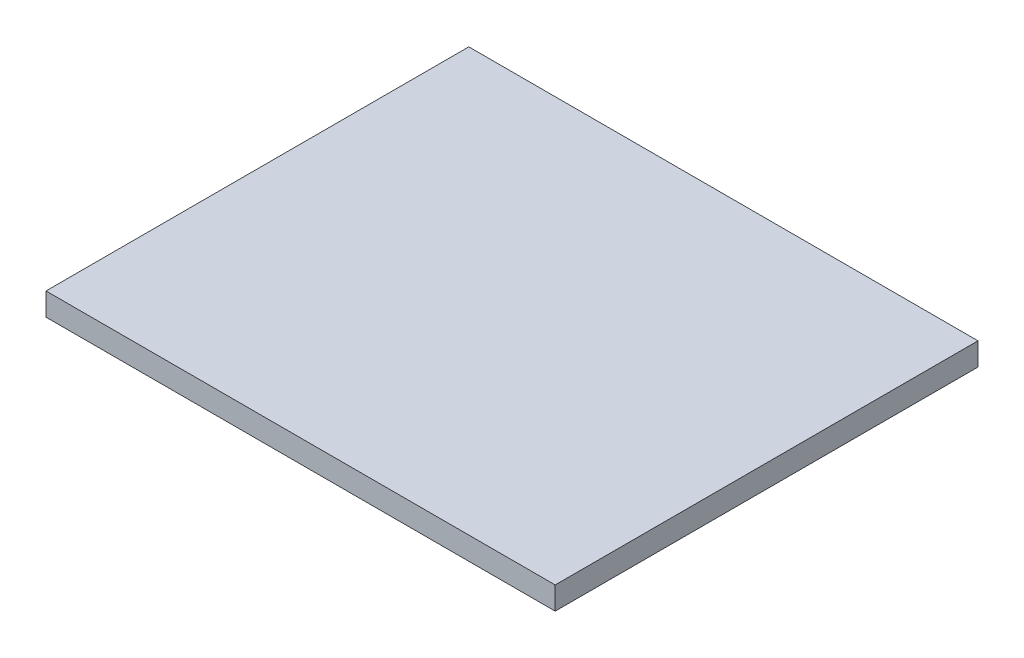
ISO-10303-21;
HEADER;
FILE_DESCRIPTION(('STEP AP214'),'2;1');
FILE_NAME('part.step','',(''),(''),'','','');
FILE_SCHEMA(('AUTOMOTIVE_DESIGN { 1 0 10303 214 1 1 1 1 }'));
ENDSEC;
DATA;
#1=APPLICATION_CONTEXT('core data for automotive mechanical design processes');
#2=APPLICATION_PROTOCOL_DEFINITION('international standard','automotive_design',2000,#1);
#3=PRODUCT_CONTEXT('',#1,'mechanical');
#4=PRODUCT('Part','Part','',(#3));
#5=PRODUCT_RELATED_PRODUCT_CATEGORY('part','',(#4));
#6=PRODUCT_DEFINITION_FORMATION('','',#4);
#7=PRODUCT_DEFINITION_CONTEXT('part definition',#1,'design');
#8=PRODUCT_DEFINITION('design','',#6,#7);
#9=PRODUCT_DEFINITION_SHAPE('','',#8);
#10=(LENGTH_UNIT() NAMED_UNIT(*) SI_UNIT(.MILLI.,.METRE.));
#11=(NAMED_UNIT(*) PLANE_ANGLE_UNIT() SI_UNIT($,.RADIAN.));
#12=(NAMED_UNIT(*) SI_UNIT($,.STERADIAN.) SOLID_ANGLE_UNIT());
#13=UNCERTAINTY_MEASURE_WITH_UNIT(LENGTH_MEASURE(1.E-05),#10,'distance_accuracy_value','');
#14=(GEOMETRIC_REPRESENTATION_CONTEXT(3) GLOBAL_UNCERTAINTY_ASSIGNED_CONTEXT((#13)) GLOBAL_UNIT_ASSIGNED_CONTEXT((#10,
#11,#12)) REPRESENTATION_CONTEXT('',''));
#15=CARTESIAN_POINT('',(0.,0.,0.));
#16=DIRECTION('',(0.,0.,1.));
#17=DIRECTION('',(1.,0.,0.));
#18=AXIS2_PLACEMENT_3D('',#15,#16,#17);
#19=CARTESIAN_POINT('',(0.,-2.5,0.));
#20=DIRECTION('',(0.,-1.,0.));
#21=DIRECTION('',(0.,0.,-1.));
#22=AXIS2_PLACEMENT_3D('',#19,#20,#21);
#23=PLANE('',#22);
#24=DIRECTION('',(0.,0.,-1.));
#25=VECTOR('',#24,1.);
#26=CARTESIAN_POINT('',(-3.,-2.5,20.75));
#27=LINE('',#26,#25);
#28=CARTESIAN_POINT('',(-3.,-2.5,20.75));
#29=VERTEX_POINT('',#28);
#30=CARTESIAN_POINT('',(-3.,-2.5,18.25));
#31=VERTEX_POINT('',#30);
#32=EDGE_CURVE('E288',#29,#31,#27,.T.);
#33=ORIENTED_EDGE('',*,*,#32,.F.);
#34=DIRECTION('',(-1.,0.,0.));
#35=VECTOR('',#34,1.);
#36=CARTESIAN_POINT('',(25.5,-2.5,20.75));
#37=LINE('',#36,#35);
#38=CARTESIAN_POINT('',(-25.5,-2.5,20.75));
#39=VERTEX_POINT('',#38);
#40=EDGE_CURVE('E292',#29,#39,#37,.T.);
#41=ORIENTED_EDGE('',*,*,#40,.T.);
#42=DIRECTION('',(0.,0.,-1.));
#43=VECTOR('',#42,1.);
#44=CARTESIAN_POINT('',(-25.5,-2.5,20.75));
#45=LINE('',#44,#43);
#46=CARTESIAN_POINT('',(-25.5,-2.5,2.99999999999999));
#47=VERTEX_POINT('',#46);
#48=EDGE_CURVE('E271',#39,#47,#45,.T.);
#49=ORIENTED_EDGE('',*,*,#48,.T.);
#50=DIRECTION('',(-1.,0.,0.));
#51=VECTOR('',#50,1.);
#52=CARTESIAN_POINT('',(-3.,-2.5,2.99999999999999));
#53=LINE('',#52,#51);
#54=CARTESIAN_POINT('',(-23.,-2.5,2.99999999999999));
#55=VERTEX_POINT('',#54);
#56=EDGE_CURVE('E280',#55,#47,#53,.T.);
#57=ORIENTED_EDGE('',*,*,#56,.F.);
#58=DIRECTION('',(0.,0.,-1.));
#59=VECTOR('',#58,1.);
#60=CARTESIAN_POINT('',(-23.,-2.5,18.25));
#61=LINE('',#60,#59);
#62=CARTESIAN_POINT('',(-23.,-2.5,18.25));
#63=VERTEX_POINT('',#62);
#64=EDGE_CURVE('E470',#63,#55,#61,.T.);
#65=ORIENTED_EDGE('',*,*,#64,.F.);
#66=DIRECTION('',(-1.,0.,0.));
#67=VECTOR('',#66,1.);
#68=CARTESIAN_POINT('',(23.,-2.5,18.25));
#69=LINE('',#68,#67);
#70=EDGE_CURVE('E488',#31,#63,#69,.T.);
#71=ORIENTED_EDGE('',*,*,#70,.F.);
#72=EDGE_LOOP('',(#33,#41,#49,#57,#65,#71));
#73=FACE_BOUND('',#72,.T.);
#74=ADVANCED_FACE('F33',(#73),#23,.T.);
#75=DIRECTION('',(0.,0.,1.));
#76=VECTOR('',#75,1.);
#77=CARTESIAN_POINT('',(3.,-2.5,20.75));
#78=LINE('',#77,#76);
#79=CARTESIAN_POINT('',(3.,-2.5,18.25));
#80=VERTEX_POINT('',#79);
#81=CARTESIAN_POINT('',(3.,-2.5,20.75));
#82=VERTEX_POINT('',#81);
#83=EDGE_CURVE('E277',#80,#82,#78,.T.);
#84=ORIENTED_EDGE('',*,*,#83,.F.);
#85=CARTESIAN_POINT('',(23.,-2.5,18.25));
#86=VERTEX_POINT('',#85);
#87=EDGE_CURVE('E485',#86,#80,#69,.T.);
#88=ORIENTED_EDGE('',*,*,#87,.F.);
#89=DIRECTION('',(0.,0.,1.));
#90=VECTOR('',#89,1.);
#91=CARTESIAN_POINT('',(23.,-2.5,-18.25));
#92=LINE('',#91,#90);
#93=CARTESIAN_POINT('',(23.,-2.5,2.99999999999999));
#94=VERTEX_POINT('',#93);
#95=EDGE_CURVE('E492',#94,#86,#92,.T.);
#96=ORIENTED_EDGE('',*,*,#95,.F.);
#97=DIRECTION('',(-1.,0.,0.));
#98=VECTOR('',#97,1.);
#99=CARTESIAN_POINT('',(25.5,-2.5,2.99999999999999));
#100=LINE('',#99,#98);
#101=CARTESIAN_POINT('',(25.5,-2.5,2.99999999999999));
#102=VERTEX_POINT('',#101);
#103=EDGE_CURVE('E528',#102,#94,#100,.T.);
#104=ORIENTED_EDGE('',*,*,#103,.F.);
#105=DIRECTION('',(0.,0.,1.));
#106=VECTOR('',#105,1.);
#107=CARTESIAN_POINT('',(25.5,-2.5,-20.75));
#108=LINE('',#107,#106);
#109=CARTESIAN_POINT('',(25.5,-2.5,20.75));
#110=VERTEX_POINT('',#109);
#111=EDGE_CURVE('E450',#102,#110,#108,.T.);
#112=ORIENTED_EDGE('',*,*,#111,.T.);
#113=EDGE_CURVE('E300',#110,#82,#37,.T.);
#114=ORIENTED_EDGE('',*,*,#113,.T.);
#115=EDGE_LOOP('',(#84,#88,#96,#104,#112,#114));
#116=FACE_BOUND('',#115,.T.);
#117=ADVANCED_FACE('F555',(#116),#23,.T.);
#118=DIRECTION('',(1.,0.,0.));
#119=VECTOR('',#118,1.);
#120=CARTESIAN_POINT('',(25.5,-2.5,-3.00000000000001));
#121=LINE('',#120,#119);
#122=CARTESIAN_POINT('',(23.,-2.5,-3.00000000000001));
#123=VERTEX_POINT('',#122);
#124=CARTESIAN_POINT('',(25.5,-2.5,-3.00000000000001));
#125=VERTEX_POINT('',#124);
#126=EDGE_CURVE('E530',#123,#125,#121,.T.);
#127=ORIENTED_EDGE('',*,*,#126,.F.);
#128=CARTESIAN_POINT('',(23.,-2.5,-18.25));
#129=VERTEX_POINT('',#128);
#130=EDGE_CURVE('E489',#129,#123,#92,.T.);
#131=ORIENTED_EDGE('',*,*,#130,.F.);
#132=DIRECTION('',(1.,0.,0.));
#133=VECTOR('',#132,1.);
#134=CARTESIAN_POINT('',(-23.,-2.5,-18.25));
#135=LINE('',#134,#133);
#136=CARTESIAN_POINT('',(3.00000000000001,-2.5,-18.25));
#137=VERTEX_POINT('',#136);
#138=EDGE_CURVE('E473',#137,#129,#135,.T.);
#139=ORIENTED_EDGE('',*,*,#138,.F.);
#140=DIRECTION('',(0.,0.,1.));
#141=VECTOR('',#140,1.);
#142=CARTESIAN_POINT('',(3.,-2.5,-3.00000000000001));
#143=LINE('',#142,#141);
#144=CARTESIAN_POINT('',(3.00000000000001,-2.5,-20.75));
#145=VERTEX_POINT('',#144);
#146=EDGE_CURVE('E533',#145,#137,#143,.T.);
#147=ORIENTED_EDGE('',*,*,#146,.F.);
#148=DIRECTION('',(1.,0.,0.));
#149=VECTOR('',#148,1.);
#150=CARTESIAN_POINT('',(-25.5,-2.5,-20.75));
#151=LINE('',#150,#149);
#152=CARTESIAN_POINT('',(25.5,-2.5,-20.75));
#153=VERTEX_POINT('',#152);
#154=EDGE_CURVE('E315',#145,#153,#151,.T.);
#155=ORIENTED_EDGE('',*,*,#154,.T.);
#156=EDGE_CURVE('E453',#153,#125,#108,.T.);
#157=ORIENTED_EDGE('',*,*,#156,.T.);
#158=EDGE_LOOP('',(#127,#131,#139,#147,#155,#157));
#159=FACE_BOUND('',#158,.T.);
#160=ADVANCED_FACE('F591',(#159),#23,.T.);
#161=CARTESIAN_POINT('',(-25.5,-2.5,-20.75));
#162=DIRECTION('',(0.,0.,1.));
#163=DIRECTION('',(1.,0.,0.));
#164=AXIS2_PLACEMENT_3D('',#161,#162,#163);
#165=PLANE('',#164);
#166=ORIENTED_EDGE('',*,*,#154,.F.);
#167=DIRECTION('',(0.,-1.,0.));
#168=VECTOR('',#167,1.);
#169=CARTESIAN_POINT('',(3.00000000000001,0.,-20.75));
#170=LINE('',#169,#168);
#171=CARTESIAN_POINT('',(3.00000000000001,-2.,-20.75));
#172=VERTEX_POINT('',#171);
#173=EDGE_CURVE('E518',#172,#145,#170,.T.);
#174=ORIENTED_EDGE('',*,*,#173,.F.);
#175=CARTESIAN_POINT('',(1.00000000000001,-2.,-20.75));
#176=DIRECTION('',(0.,0.,1.));
#177=DIRECTION('',(1.,0.,0.));
#178=AXIS2_PLACEMENT_3D('',#175,#176,#177);
#179=CIRCLE('',#178,2.);
#180=CARTESIAN_POINT('',(1.00000000000001,0.,-20.75));
#181=VERTEX_POINT('',#180);
#182=EDGE_CURVE('E405',#172,#181,#179,.T.);
#183=ORIENTED_EDGE('',*,*,#182,.T.);
#184=DIRECTION('',(1.,0.,0.));
#185=VECTOR('',#184,1.);
#186=CARTESIAN_POINT('',(-25.5,0.,-20.75));
#187=LINE('',#186,#185);
#188=CARTESIAN_POINT('',(25.5,0.,-20.75));
#189=VERTEX_POINT('',#188);
#190=EDGE_CURVE('E307',#181,#189,#187,.T.);
#191=ORIENTED_EDGE('',*,*,#190,.T.);
#192=DIRECTION('',(0.,1.,0.));
#193=VECTOR('',#192,1.);
#194=CARTESIAN_POINT('',(25.5,-2.5,-20.75));
#195=LINE('',#194,#193);
#196=EDGE_CURVE('E321',#153,#189,#195,.T.);
#197=ORIENTED_EDGE('',*,*,#196,.F.);
#198=EDGE_LOOP('',(#166,#174,#183,#191,#197));
#199=FACE_BOUND('',#198,.T.);
#200=ADVANCED_FACE('F605',(#199),#165,.F.);
#201=CARTESIAN_POINT('',(25.5,-2.5,-20.75));
#202=DIRECTION('',(-1.,0.,0.));
#203=DIRECTION('',(0.,0.,1.));
#204=AXIS2_PLACEMENT_3D('',#201,#202,#203);
#205=PLANE('',#204);
#206=ORIENTED_EDGE('',*,*,#111,.F.);
#207=DIRECTION('',(0.,-1.,0.));
#208=VECTOR('',#207,1.);
#209=CARTESIAN_POINT('',(25.5,0.,2.99999999999999));
#210=LINE('',#209,#208);
#211=CARTESIAN_POINT('',(25.5,-2.,2.99999999999999));
#212=VERTEX_POINT('',#211);
#213=EDGE_CURVE('E434',#212,#102,#210,.T.);
#214=ORIENTED_EDGE('',*,*,#213,.F.);
#215=CARTESIAN_POINT('',(25.5,-2.,0.999999999999994));
#216=DIRECTION('',(-1.,0.,0.));
#217=DIRECTION('',(0.,0.,1.));
#218=AXIS2_PLACEMENT_3D('',#215,#216,#217);
#219=CIRCLE('',#218,2.);
#220=CARTESIAN_POINT('',(25.5,0.,0.999999999999994));
#221=VERTEX_POINT('',#220);
#222=EDGE_CURVE('E424',#212,#221,#219,.T.);
#223=ORIENTED_EDGE('',*,*,#222,.T.);
#224=DIRECTION('',(0.,0.,1.));
#225=VECTOR('',#224,1.);
#226=CARTESIAN_POINT('',(25.5,0.,-20.75));
#227=LINE('',#226,#225);
#228=CARTESIAN_POINT('',(25.5,0.,20.75));
#229=VERTEX_POINT('',#228);
#230=EDGE_CURVE('E306',#221,#229,#227,.T.);
#231=ORIENTED_EDGE('',*,*,#230,.T.);
#232=DIRECTION('',(0.,1.,0.));
#233=VECTOR('',#232,1.);
#234=CARTESIAN_POINT('',(25.5,-2.5,20.75));
#235=LINE('',#234,#233);
#236=EDGE_CURVE('E318',#110,#229,#235,.T.);
#237=ORIENTED_EDGE('',*,*,#236,.F.);
#238=EDGE_LOOP('',(#206,#214,#223,#231,#237));
#239=FACE_BOUND('',#238,.T.);
#240=ADVANCED_FACE('F431',(#239),#205,.F.);
#241=CARTESIAN_POINT('',(25.5,-2.5,20.75));
#242=DIRECTION('',(0.,0.,-1.));
#243=DIRECTION('',(-1.,0.,0.));
#244=AXIS2_PLACEMENT_3D('',#241,#242,#243);
#245=PLANE('',#244);
#246=ORIENTED_EDGE('',*,*,#40,.F.);
#247=DIRECTION('',(0.,-1.,0.));
#248=VECTOR('',#247,1.);
#249=CARTESIAN_POINT('',(-3.,0.,20.75));
#250=LINE('',#249,#248);
#251=CARTESIAN_POINT('',(-3.,-2.,20.75));
#252=VERTEX_POINT('',#251);
#253=EDGE_CURVE('E513',#252,#29,#250,.T.);
#254=ORIENTED_EDGE('',*,*,#253,.F.);
#255=CARTESIAN_POINT('',(-0.999999999999999,-2.,20.75));
#256=DIRECTION('',(0.,0.,-1.));
#257=DIRECTION('',(-1.,0.,0.));
#258=AXIS2_PLACEMENT_3D('',#255,#256,#257);
#259=CIRCLE('',#258,2.);
#260=CARTESIAN_POINT('',(-1.,0.,20.75));
#261=VERTEX_POINT('',#260);
#262=EDGE_CURVE('E11',#252,#261,#259,.T.);
#263=ORIENTED_EDGE('',*,*,#262,.T.);
#264=DIRECTION('',(-1.,0.,0.));
#265=VECTOR('',#264,1.);
#266=CARTESIAN_POINT('',(25.5,0.,20.75));
#267=LINE('',#266,#265);
#268=CARTESIAN_POINT('',(-25.5,0.,20.75));
#269=VERTEX_POINT('',#268);
#270=EDGE_CURVE('E310',#261,#269,#267,.T.);
#271=ORIENTED_EDGE('',*,*,#270,.T.);
#272=DIRECTION('',(0.,1.,0.));
#273=VECTOR('',#272,1.);
#274=CARTESIAN_POINT('',(-25.5,-2.5,20.75));
#275=LINE('',#274,#273);
#276=EDGE_CURVE('E298',#39,#269,#275,.T.);
#277=ORIENTED_EDGE('',*,*,#276,.F.);
#278=EDGE_LOOP('',(#246,#254,#263,#271,#277));
#279=FACE_BOUND('',#278,.T.);
#280=ADVANCED_FACE('F553',(#279),#245,.F.);
#281=CARTESIAN_POINT('',(-25.5,-2.5,20.75));
#282=DIRECTION('',(1.,0.,0.));
#283=DIRECTION('',(0.,0.,-1.));
#284=AXIS2_PLACEMENT_3D('',#281,#282,#283);
#285=PLANE('',#284);
#286=CARTESIAN_POINT('',(-25.5,-2.5,-3.00000000000001));
#287=VERTEX_POINT('',#286);
#288=CARTESIAN_POINT('',(-25.5,-2.5,-20.75));
#289=VERTEX_POINT('',#288);
#290=EDGE_CURVE('E295',#287,#289,#45,.T.);
#291=ORIENTED_EDGE('',*,*,#290,.F.);
#292=DIRECTION('',(0.,-1.,0.));
#293=VECTOR('',#292,1.);
#294=CARTESIAN_POINT('',(-25.5,0.,-3.00000000000001));
#295=LINE('',#294,#293);
#296=CARTESIAN_POINT('',(-25.5,-2.,-3.00000000000001));
#297=VERTEX_POINT('',#296);
#298=EDGE_CURVE('E276',#297,#287,#295,.T.);
#299=ORIENTED_EDGE('',*,*,#298,.F.);
#300=CARTESIAN_POINT('',(-25.5,-2.,-1.00000000000001));
#301=DIRECTION('',(1.,0.,0.));
#302=DIRECTION('',(0.,0.,-1.));
#303=AXIS2_PLACEMENT_3D('',#300,#301,#302);
#304=CIRCLE('',#303,2.);
#305=CARTESIAN_POINT('',(-25.5,0.,-1.));
#306=VERTEX_POINT('',#305);
#307=EDGE_CURVE('E395',#297,#306,#304,.T.);
#308=ORIENTED_EDGE('',*,*,#307,.T.);
#309=DIRECTION('',(0.,0.,-1.));
#310=VECTOR('',#309,1.);
#311=CARTESIAN_POINT('',(-25.5,0.,20.75));
#312=LINE('',#311,#310);
#313=CARTESIAN_POINT('',(-25.5,0.,-20.75));
#314=VERTEX_POINT('',#313);
#315=EDGE_CURVE('E313',#306,#314,#312,.T.);
#316=ORIENTED_EDGE('',*,*,#315,.T.);
#317=DIRECTION('',(0.,1.,0.));
#318=VECTOR('',#317,1.);
#319=CARTESIAN_POINT('',(-25.5,-2.5,-20.75));
#320=LINE('',#319,#318);
#321=EDGE_CURVE('E294',#289,#314,#320,.T.);
#322=ORIENTED_EDGE('',*,*,#321,.F.);
#323=EDGE_LOOP('',(#291,#299,#308,#316,#322));
#324=FACE_BOUND('',#323,.T.);
#325=ADVANCED_FACE('F827',(#324),#285,.F.);
#326=CARTESIAN_POINT('',(-23.,-2.5,-18.25));
#327=DIRECTION('',(0.,0.,1.));
#328=DIRECTION('',(1.,0.,0.));
#329=AXIS2_PLACEMENT_3D('',#326,#327,#328);
#330=PLANE('',#329);
#331=DIRECTION('',(0.,1.,0.));
#332=VECTOR('',#331,1.);
#333=CARTESIAN_POINT('',(3.00000000000001,-2.5,-18.25));
#334=LINE('',#333,#332);
#335=CARTESIAN_POINT('',(3.00000000000001,-2.,-18.25));
#336=VERTEX_POINT('',#335);
#337=EDGE_CURVE('E505',#137,#336,#334,.T.);
#338=ORIENTED_EDGE('',*,*,#337,.F.);
#339=ORIENTED_EDGE('',*,*,#138,.T.);
#340=DIRECTION('',(0.,1.,0.));
#341=VECTOR('',#340,1.);
#342=CARTESIAN_POINT('',(23.,-2.5,-18.25));
#343=LINE('',#342,#341);
#344=CARTESIAN_POINT('',(23.,0.,-18.25));
#345=VERTEX_POINT('',#344);
#346=EDGE_CURVE('E459',#129,#345,#343,.T.);
#347=ORIENTED_EDGE('',*,*,#346,.T.);
#348=DIRECTION('',(1.,0.,0.));
#349=VECTOR('',#348,1.);
#350=CARTESIAN_POINT('',(-23.,0.,-18.25));
#351=LINE('',#350,#349);
#352=CARTESIAN_POINT('',(1.00000000000001,0.,-18.25));
#353=VERTEX_POINT('',#352);
#354=EDGE_CURVE('E482',#353,#345,#351,.T.);
#355=ORIENTED_EDGE('',*,*,#354,.F.);
#356=CARTESIAN_POINT('',(1.00000000000001,-2.,-18.25));
#357=DIRECTION('',(0.,0.,1.));
#358=DIRECTION('',(1.,0.,0.));
#359=AXIS2_PLACEMENT_3D('',#356,#357,#358);
#360=CIRCLE('',#359,2.);
#361=EDGE_CURVE('E403',#353,#336,#360,.F.);
#362=ORIENTED_EDGE('',*,*,#361,.T.);
#363=EDGE_LOOP('',(#338,#339,#347,#355,#362));
#364=FACE_BOUND('',#363,.T.);
#365=ADVANCED_FACE('F629',(#364),#330,.T.);
#366=CARTESIAN_POINT('',(23.,-2.5,-18.25));
#367=DIRECTION('',(-1.,0.,0.));
#368=DIRECTION('',(0.,0.,1.));
#369=AXIS2_PLACEMENT_3D('',#366,#367,#368);
#370=PLANE('',#369);
#371=DIRECTION('',(0.,1.,0.));
#372=VECTOR('',#371,1.);
#373=CARTESIAN_POINT('',(23.,-2.5,2.99999999999999));
#374=LINE('',#373,#372);
#375=CARTESIAN_POINT('',(23.,-2.,2.99999999999999));
#376=VERTEX_POINT('',#375);
#377=EDGE_CURVE('E500',#94,#376,#374,.T.);
#378=ORIENTED_EDGE('',*,*,#377,.F.);
#379=ORIENTED_EDGE('',*,*,#95,.T.);
#380=DIRECTION('',(0.,1.,0.));
#381=VECTOR('',#380,1.);
#382=CARTESIAN_POINT('',(23.,-2.5,18.25));
#383=LINE('',#382,#381);
#384=CARTESIAN_POINT('',(23.,0.,18.25));
#385=VERTEX_POINT('',#384);
#386=EDGE_CURVE('E462',#86,#385,#383,.T.);
#387=ORIENTED_EDGE('',*,*,#386,.T.);
#388=DIRECTION('',(0.,0.,1.));
#389=VECTOR('',#388,1.);
#390=CARTESIAN_POINT('',(23.,0.,-18.25));
#391=LINE('',#390,#389);
#392=CARTESIAN_POINT('',(23.,0.,0.999999999999994));
#393=VERTEX_POINT('',#392);
#394=EDGE_CURVE('E442',#393,#385,#391,.T.);
#395=ORIENTED_EDGE('',*,*,#394,.F.);
#396=CARTESIAN_POINT('',(23.,-2.,0.999999999999994));
#397=DIRECTION('',(-1.,0.,0.));
#398=DIRECTION('',(0.,0.,1.));
#399=AXIS2_PLACEMENT_3D('',#396,#397,#398);
#400=CIRCLE('',#399,2.);
#401=EDGE_CURVE('E422',#393,#376,#400,.F.);
#402=ORIENTED_EDGE('',*,*,#401,.T.);
#403=EDGE_LOOP('',(#378,#379,#387,#395,#402));
#404=FACE_BOUND('',#403,.T.);
#405=ADVANCED_FACE('F568',(#404),#370,.T.);
#406=CARTESIAN_POINT('',(23.,-2.5,18.25));
#407=DIRECTION('',(0.,0.,-1.));
#408=DIRECTION('',(-1.,0.,0.));
#409=AXIS2_PLACEMENT_3D('',#406,#407,#408);
#410=PLANE('',#409);
#411=DIRECTION('',(0.,1.,0.));
#412=VECTOR('',#411,1.);
#413=CARTESIAN_POINT('',(-3.,-2.5,18.25));
#414=LINE('',#413,#412);
#415=CARTESIAN_POINT('',(-3.,-2.,18.25));
#416=VERTEX_POINT('',#415);
#417=EDGE_CURVE('E496',#31,#416,#414,.T.);
#418=ORIENTED_EDGE('',*,*,#417,.F.);
#419=ORIENTED_EDGE('',*,*,#70,.T.);
#420=DIRECTION('',(0.,1.,0.));
#421=VECTOR('',#420,1.);
#422=CARTESIAN_POINT('',(-23.,-2.5,18.25));
#423=LINE('',#422,#421);
#424=CARTESIAN_POINT('',(-23.,0.,18.25));
#425=VERTEX_POINT('',#424);
#426=EDGE_CURVE('E464',#63,#425,#423,.T.);
#427=ORIENTED_EDGE('',*,*,#426,.T.);
#428=DIRECTION('',(-1.,0.,0.));
#429=VECTOR('',#428,1.);
#430=CARTESIAN_POINT('',(23.,0.,18.25));
#431=LINE('',#430,#429);
#432=CARTESIAN_POINT('',(-0.999999999999999,0.,18.25));
#433=VERTEX_POINT('',#432);
#434=EDGE_CURVE('E477',#433,#425,#431,.T.);
#435=ORIENTED_EDGE('',*,*,#434,.F.);
#436=CARTESIAN_POINT('',(-0.999999999999999,-2.,18.25));
#437=DIRECTION('',(0.,0.,-1.));
#438=DIRECTION('',(-1.,0.,0.));
#439=AXIS2_PLACEMENT_3D('',#436,#437,#438);
#440=CIRCLE('',#439,2.);
#441=EDGE_CURVE('E41',#433,#416,#440,.F.);
#442=ORIENTED_EDGE('',*,*,#441,.T.);
#443=EDGE_LOOP('',(#418,#419,#427,#435,#442));
#444=FACE_BOUND('',#443,.T.);
#445=ADVANCED_FACE('F541',(#444),#410,.T.);
#446=CARTESIAN_POINT('',(-23.,-2.5,18.25));
#447=DIRECTION('',(1.,0.,0.));
#448=DIRECTION('',(0.,0.,-1.));
#449=AXIS2_PLACEMENT_3D('',#446,#447,#448);
#450=PLANE('',#449);
#451=DIRECTION('',(0.,1.,0.));
#452=VECTOR('',#451,1.);
#453=CARTESIAN_POINT('',(-23.,-2.5,-3.00000000000001));
#454=LINE('',#453,#452);
#455=CARTESIAN_POINT('',(-23.,-2.5,-3.00000000000001));
#456=VERTEX_POINT('',#455);
#457=CARTESIAN_POINT('',(-23.,-2.,-3.00000000000001));
#458=VERTEX_POINT('',#457);
#459=EDGE_CURVE('E510',#456,#458,#454,.T.);
#460=ORIENTED_EDGE('',*,*,#459,.F.);
#461=CARTESIAN_POINT('',(-23.,-2.5,-18.25));
#462=VERTEX_POINT('',#461);
#463=EDGE_CURVE('E484',#456,#462,#61,.T.);
#464=ORIENTED_EDGE('',*,*,#463,.T.);
#465=DIRECTION('',(0.,1.,0.));
#466=VECTOR('',#465,1.);
#467=CARTESIAN_POINT('',(-23.,-2.5,-18.25));
#468=LINE('',#467,#466);
#469=CARTESIAN_POINT('',(-23.,0.,-18.25));
#470=VERTEX_POINT('',#469);
#471=EDGE_CURVE('E467',#462,#470,#468,.T.);
#472=ORIENTED_EDGE('',*,*,#471,.T.);
#473=DIRECTION('',(0.,0.,-1.));
#474=VECTOR('',#473,1.);
#475=CARTESIAN_POINT('',(-23.,0.,18.25));
#476=LINE('',#475,#474);
#477=CARTESIAN_POINT('',(-23.,0.,-1.00000000000001));
#478=VERTEX_POINT('',#477);
#479=EDGE_CURVE('E474',#478,#470,#476,.T.);
#480=ORIENTED_EDGE('',*,*,#479,.F.);
#481=CARTESIAN_POINT('',(-23.,-2.,-1.00000000000001));
#482=DIRECTION('',(1.,0.,0.));
#483=DIRECTION('',(0.,0.,-1.));
#484=AXIS2_PLACEMENT_3D('',#481,#482,#483);
#485=CIRCLE('',#484,2.);
#486=EDGE_CURVE('E393',#478,#458,#485,.F.);
#487=ORIENTED_EDGE('',*,*,#486,.T.);
#488=EDGE_LOOP('',(#460,#464,#472,#480,#487));
#489=FACE_BOUND('',#488,.T.);
#490=ADVANCED_FACE('F793',(#489),#450,.T.);
#491=CARTESIAN_POINT('',(28.,2.5,-23.25));
#492=DIRECTION('',(-1.,0.,0.));
#493=DIRECTION('',(0.,0.,1.));
#494=AXIS2_PLACEMENT_3D('',#491,#492,#493);
#495=PLANE('',#494);
#496=DIRECTION('',(0.,0.,-1.));
#497=VECTOR('',#496,1.);
#498=CARTESIAN_POINT('',(28.,0.,-23.25));
#499=LINE('',#498,#497);
#500=CARTESIAN_POINT('',(28.,0.,23.25));
#501=VERTEX_POINT('',#500);
#502=CARTESIAN_POINT('',(28.,0.,-23.25));
#503=VERTEX_POINT('',#502);
#504=EDGE_CURVE('E324',#501,#503,#499,.T.);
#505=ORIENTED_EDGE('',*,*,#504,.T.);
#506=DIRECTION('',(0.,-1.,0.));
#507=VECTOR('',#506,1.);
#508=CARTESIAN_POINT('',(28.,2.5,-23.25));
#509=LINE('',#508,#507);
#510=CARTESIAN_POINT('',(28.,2.5,-23.25));
#511=VERTEX_POINT('',#510);
#512=EDGE_CURVE('E351',#511,#503,#509,.T.);
#513=ORIENTED_EDGE('',*,*,#512,.F.);
#514=DIRECTION('',(0.,0.,-1.));
#515=VECTOR('',#514,1.);
#516=CARTESIAN_POINT('',(28.,2.5,-23.25));
#517=LINE('',#516,#515);
#518=CARTESIAN_POINT('',(28.,2.5,23.25));
#519=VERTEX_POINT('',#518);
#520=EDGE_CURVE('E325',#519,#511,#517,.T.);
#521=ORIENTED_EDGE('',*,*,#520,.F.);
#522=DIRECTION('',(0.,-1.,0.));
#523=VECTOR('',#522,1.);
#524=CARTESIAN_POINT('',(28.,2.5,23.25));
#525=LINE('',#524,#523);
#526=EDGE_CURVE('E335',#519,#501,#525,.T.);
#527=ORIENTED_EDGE('',*,*,#526,.T.);
#528=EDGE_LOOP('',(#505,#513,#521,#527));
#529=FACE_BOUND('',#528,.T.);
#530=ADVANCED_FACE('F857',(#529),#495,.F.);
#531=CARTESIAN_POINT('',(-28.,2.5,-23.25));
#532=DIRECTION('',(0.,0.,1.));
#533=DIRECTION('',(1.,0.,0.));
#534=AXIS2_PLACEMENT_3D('',#531,#532,#533);
#535=PLANE('',#534);
#536=DIRECTION('',(-1.,0.,0.));
#537=VECTOR('',#536,1.);
#538=CARTESIAN_POINT('',(-28.,0.,-23.25));
#539=LINE('',#538,#537);
#540=CARTESIAN_POINT('',(-28.,0.,-23.25));
#541=VERTEX_POINT('',#540);
#542=EDGE_CURVE('E338',#503,#541,#539,.T.);
#543=ORIENTED_EDGE('',*,*,#542,.T.);
#544=DIRECTION('',(0.,-1.,0.));
#545=VECTOR('',#544,1.);
#546=CARTESIAN_POINT('',(-28.,2.5,-23.25));
#547=LINE('',#546,#545);
#548=CARTESIAN_POINT('',(-28.,2.5,-23.25));
#549=VERTEX_POINT('',#548);
#550=EDGE_CURVE('E348',#549,#541,#547,.T.);
#551=ORIENTED_EDGE('',*,*,#550,.F.);
#552=DIRECTION('',(-1.,0.,0.));
#553=VECTOR('',#552,1.);
#554=CARTESIAN_POINT('',(-28.,2.5,-23.25));
#555=LINE('',#554,#553);
#556=EDGE_CURVE('E328',#511,#549,#555,.T.);
#557=ORIENTED_EDGE('',*,*,#556,.F.);
#558=ORIENTED_EDGE('',*,*,#512,.T.);
#559=EDGE_LOOP('',(#543,#551,#557,#558));
#560=FACE_BOUND('',#559,.T.);
#561=ADVANCED_FACE('F948',(#560),#535,.F.);
#562=CARTESIAN_POINT('',(-28.,2.5,-23.25));
#563=DIRECTION('',(1.,0.,0.));
#564=DIRECTION('',(0.,0.,-1.));
#565=AXIS2_PLACEMENT_3D('',#562,#563,#564);
#566=PLANE('',#565);
#567=DIRECTION('',(0.,0.,1.));
#568=VECTOR('',#567,1.);
#569=CARTESIAN_POINT('',(-28.,0.,-23.25));
#570=LINE('',#569,#568);
#571=CARTESIAN_POINT('',(-28.,0.,23.25));
#572=VERTEX_POINT('',#571);
#573=EDGE_CURVE('E340',#541,#572,#570,.T.);
#574=ORIENTED_EDGE('',*,*,#573,.T.);
#575=DIRECTION('',(0.,-1.,0.));
#576=VECTOR('',#575,1.);
#577=CARTESIAN_POINT('',(-28.,2.5,23.25));
#578=LINE('',#577,#576);
#579=CARTESIAN_POINT('',(-28.,2.5,23.25));
#580=VERTEX_POINT('',#579);
#581=EDGE_CURVE('E345',#580,#572,#578,.T.);
#582=ORIENTED_EDGE('',*,*,#581,.F.);
#583=DIRECTION('',(0.,0.,1.));
#584=VECTOR('',#583,1.);
#585=CARTESIAN_POINT('',(-28.,2.5,-23.25));
#586=LINE('',#585,#584);
#587=EDGE_CURVE('E331',#549,#580,#586,.T.);
#588=ORIENTED_EDGE('',*,*,#587,.F.);
#589=ORIENTED_EDGE('',*,*,#550,.T.);
#590=EDGE_LOOP('',(#574,#582,#588,#589));
#591=FACE_BOUND('',#590,.T.);
#592=ADVANCED_FACE('F938',(#591),#566,.F.);
#593=CARTESIAN_POINT('',(-28.,2.5,23.25));
#594=DIRECTION('',(0.,0.,-1.));
#595=DIRECTION('',(-1.,0.,0.));
#596=AXIS2_PLACEMENT_3D('',#593,#594,#595);
#597=PLANE('',#596);
#598=DIRECTION('',(1.,0.,0.));
#599=VECTOR('',#598,1.);
#600=CARTESIAN_POINT('',(-28.,0.,23.25));
#601=LINE('',#600,#599);
#602=EDGE_CURVE('E329',#572,#501,#601,.T.);
#603=ORIENTED_EDGE('',*,*,#602,.T.);
#604=ORIENTED_EDGE('',*,*,#526,.F.);
#605=DIRECTION('',(1.,0.,0.));
#606=VECTOR('',#605,1.);
#607=CARTESIAN_POINT('',(-28.,2.5,23.25));
#608=LINE('',#607,#606);
#609=EDGE_CURVE('E333',#580,#519,#608,.T.);
#610=ORIENTED_EDGE('',*,*,#609,.F.);
#611=ORIENTED_EDGE('',*,*,#581,.T.);
#612=EDGE_LOOP('',(#603,#604,#610,#611));
#613=FACE_BOUND('',#612,.T.);
#614=ADVANCED_FACE('F606',(#613),#597,.F.);
#615=CARTESIAN_POINT('',(0.,2.5,0.));
#616=DIRECTION('',(0.,1.,0.));
#617=DIRECTION('',(0.,0.,1.));
#618=AXIS2_PLACEMENT_3D('',#615,#616,#617);
#619=PLANE('',#618);
#620=ORIENTED_EDGE('',*,*,#520,.T.);
#621=ORIENTED_EDGE('',*,*,#556,.T.);
#622=ORIENTED_EDGE('',*,*,#587,.T.);
#623=ORIENTED_EDGE('',*,*,#609,.T.);
#624=EDGE_LOOP('',(#620,#621,#622,#623));
#625=FACE_BOUND('',#624,.T.);
#626=ADVANCED_FACE('F596',(#625),#619,.T.);
#627=DIRECTION('',(0.,0.,-1.));
#628=VECTOR('',#627,1.);
#629=CARTESIAN_POINT('',(-3.,-2.5,-3.00000000000001));
#630=LINE('',#629,#628);
#631=CARTESIAN_POINT('',(-2.99999999999999,-2.5,-18.25));
#632=VERTEX_POINT('',#631);
#633=CARTESIAN_POINT('',(-2.99999999999999,-2.5,-20.75));
#634=VERTEX_POINT('',#633);
#635=EDGE_CURVE('E535',#632,#634,#630,.T.);
#636=ORIENTED_EDGE('',*,*,#635,.F.);
#637=EDGE_CURVE('E493',#462,#632,#135,.T.);
#638=ORIENTED_EDGE('',*,*,#637,.F.);
#639=ORIENTED_EDGE('',*,*,#463,.F.);
#640=DIRECTION('',(1.,0.,0.));
#641=VECTOR('',#640,1.);
#642=CARTESIAN_POINT('',(-3.,-2.5,-3.00000000000001));
#643=LINE('',#642,#641);
#644=EDGE_CURVE('E287',#287,#456,#643,.T.);
#645=ORIENTED_EDGE('',*,*,#644,.F.);
#646=ORIENTED_EDGE('',*,*,#290,.T.);
#647=EDGE_CURVE('E454',#289,#634,#151,.T.);
#648=ORIENTED_EDGE('',*,*,#647,.T.);
#649=EDGE_LOOP('',(#636,#638,#639,#645,#646,#648));
#650=FACE_BOUND('',#649,.T.);
#651=ADVANCED_FACE('F587',(#650),#23,.T.);
#652=CARTESIAN_POINT('',(-0.999999999999995,0.,-20.75));
#653=VERTEX_POINT('',#652);
#654=EDGE_CURVE('E304',#314,#653,#187,.T.);
#655=ORIENTED_EDGE('',*,*,#654,.T.);
#656=CARTESIAN_POINT('',(-0.999999999999995,-2.,-20.75));
#657=DIRECTION('',(0.,0.,1.));
#658=DIRECTION('',(1.,0.,0.));
#659=AXIS2_PLACEMENT_3D('',#656,#657,#658);
#660=CIRCLE('',#659,2.);
#661=CARTESIAN_POINT('',(-2.99999999999999,-2.,-20.75));
#662=VERTEX_POINT('',#661);
#663=EDGE_CURVE('E398',#653,#662,#660,.T.);
#664=ORIENTED_EDGE('',*,*,#663,.T.);
#665=DIRECTION('',(0.,-1.,0.));
#666=VECTOR('',#665,1.);
#667=CARTESIAN_POINT('',(-2.99999999999999,0.,-20.75));
#668=LINE('',#667,#666);
#669=EDGE_CURVE('E516',#662,#634,#668,.T.);
#670=ORIENTED_EDGE('',*,*,#669,.T.);
#671=ORIENTED_EDGE('',*,*,#647,.F.);
#672=ORIENTED_EDGE('',*,*,#321,.T.);
#673=EDGE_LOOP('',(#655,#664,#670,#671,#672));
#674=FACE_BOUND('',#673,.T.);
#675=ADVANCED_FACE('F595',(#674),#165,.F.);
#676=CARTESIAN_POINT('',(25.5,0.,-1.00000000000001));
#677=VERTEX_POINT('',#676);
#678=EDGE_CURVE('E308',#189,#677,#227,.T.);
#679=ORIENTED_EDGE('',*,*,#678,.T.);
#680=CARTESIAN_POINT('',(25.5,-2.,-1.00000000000001));
#681=DIRECTION('',(-1.,0.,0.));
#682=DIRECTION('',(0.,0.,1.));
#683=AXIS2_PLACEMENT_3D('',#680,#681,#682);
#684=CIRCLE('',#683,2.);
#685=CARTESIAN_POINT('',(25.5,-2.,-3.00000000000001));
#686=VERTEX_POINT('',#685);
#687=EDGE_CURVE('E412',#677,#686,#684,.T.);
#688=ORIENTED_EDGE('',*,*,#687,.T.);
#689=DIRECTION('',(0.,-1.,0.));
#690=VECTOR('',#689,1.);
#691=CARTESIAN_POINT('',(25.5,0.,-3.00000000000001));
#692=LINE('',#691,#690);
#693=EDGE_CURVE('E520',#686,#125,#692,.T.);
#694=ORIENTED_EDGE('',*,*,#693,.T.);
#695=ORIENTED_EDGE('',*,*,#156,.F.);
#696=ORIENTED_EDGE('',*,*,#196,.T.);
#697=EDGE_LOOP('',(#679,#688,#694,#695,#696));
#698=FACE_BOUND('',#697,.T.);
#699=ADVANCED_FACE('F602',(#698),#205,.F.);
#700=CARTESIAN_POINT('',(1.,0.,20.75));
#701=VERTEX_POINT('',#700);
#702=EDGE_CURVE('E311',#229,#701,#267,.T.);
#703=ORIENTED_EDGE('',*,*,#702,.T.);
#704=CARTESIAN_POINT('',(1.,-2.,20.75));
#705=DIRECTION('',(0.,0.,-1.));
#706=DIRECTION('',(-1.,0.,0.));
#707=AXIS2_PLACEMENT_3D('',#704,#705,#706);
#708=CIRCLE('',#707,2.);
#709=CARTESIAN_POINT('',(3.,-2.,20.75));
#710=VERTEX_POINT('',#709);
#711=EDGE_CURVE('E417',#701,#710,#708,.T.);
#712=ORIENTED_EDGE('',*,*,#711,.T.);
#713=DIRECTION('',(0.,-1.,0.));
#714=VECTOR('',#713,1.);
#715=CARTESIAN_POINT('',(3.,0.,20.75));
#716=LINE('',#715,#714);
#717=EDGE_CURVE('E523',#710,#82,#716,.T.);
#718=ORIENTED_EDGE('',*,*,#717,.T.);
#719=ORIENTED_EDGE('',*,*,#113,.F.);
#720=ORIENTED_EDGE('',*,*,#236,.T.);
#721=EDGE_LOOP('',(#703,#712,#718,#719,#720));
#722=FACE_BOUND('',#721,.T.);
#723=ADVANCED_FACE('F448',(#722),#245,.F.);
#724=CARTESIAN_POINT('',(-25.5,0.,0.999999999999994));
#725=VERTEX_POINT('',#724);
#726=EDGE_CURVE('E314',#269,#725,#312,.T.);
#727=ORIENTED_EDGE('',*,*,#726,.T.);
#728=CARTESIAN_POINT('',(-25.5,-2.,0.999999999999994));
#729=DIRECTION('',(1.,0.,0.));
#730=DIRECTION('',(0.,0.,-1.));
#731=AXIS2_PLACEMENT_3D('',#728,#729,#730);
#732=CIRCLE('',#731,2.);
#733=CARTESIAN_POINT('',(-25.5,-2.,2.99999999999999));
#734=VERTEX_POINT('',#733);
#735=EDGE_CURVE('E273',#725,#734,#732,.T.);
#736=ORIENTED_EDGE('',*,*,#735,.T.);
#737=DIRECTION('',(0.,-1.,0.));
#738=VECTOR('',#737,1.);
#739=CARTESIAN_POINT('',(-25.5,0.,2.99999999999999));
#740=LINE('',#739,#738);
#741=EDGE_CURVE('E266',#734,#47,#740,.T.);
#742=ORIENTED_EDGE('',*,*,#741,.T.);
#743=ORIENTED_EDGE('',*,*,#48,.F.);
#744=ORIENTED_EDGE('',*,*,#276,.T.);
#745=EDGE_LOOP('',(#727,#736,#742,#743,#744));
#746=FACE_BOUND('',#745,.T.);
#747=ADVANCED_FACE('F268',(#746),#285,.F.);
#748=DIRECTION('',(0.,-1.,0.));
#749=VECTOR('',#748,1.);
#750=CARTESIAN_POINT('',(-3.,-2.5,-18.25));
#751=LINE('',#750,#749);
#752=CARTESIAN_POINT('',(-3.,-2.,-18.25));
#753=VERTEX_POINT('',#752);
#754=EDGE_CURVE('E508',#753,#632,#751,.T.);
#755=ORIENTED_EDGE('',*,*,#754,.F.);
#756=CARTESIAN_POINT('',(-0.999999999999995,-2.,-18.25));
#757=DIRECTION('',(0.,0.,1.));
#758=DIRECTION('',(1.,0.,0.));
#759=AXIS2_PLACEMENT_3D('',#756,#757,#758);
#760=CIRCLE('',#759,2.);
#761=CARTESIAN_POINT('',(-0.999999999999994,0.,-18.25));
#762=VERTEX_POINT('',#761);
#763=EDGE_CURVE('E400',#753,#762,#760,.F.);
#764=ORIENTED_EDGE('',*,*,#763,.T.);
#765=EDGE_CURVE('E480',#470,#762,#351,.T.);
#766=ORIENTED_EDGE('',*,*,#765,.F.);
#767=ORIENTED_EDGE('',*,*,#471,.F.);
#768=ORIENTED_EDGE('',*,*,#637,.T.);
#769=EDGE_LOOP('',(#755,#764,#766,#767,#768));
#770=FACE_BOUND('',#769,.T.);
#771=ADVANCED_FACE('F810',(#770),#330,.T.);
#772=DIRECTION('',(0.,-1.,0.));
#773=VECTOR('',#772,1.);
#774=CARTESIAN_POINT('',(23.,-2.5,-3.00000000000001));
#775=LINE('',#774,#773);
#776=CARTESIAN_POINT('',(23.,-2.,-3.00000000000001));
#777=VERTEX_POINT('',#776);
#778=EDGE_CURVE('E503',#777,#123,#775,.T.);
#779=ORIENTED_EDGE('',*,*,#778,.F.);
#780=CARTESIAN_POINT('',(23.,-2.,-1.00000000000001));
#781=DIRECTION('',(-1.,0.,0.));
#782=DIRECTION('',(0.,0.,1.));
#783=AXIS2_PLACEMENT_3D('',#780,#781,#782);
#784=CIRCLE('',#783,2.);
#785=CARTESIAN_POINT('',(23.,0.,-1.));
#786=VERTEX_POINT('',#785);
#787=EDGE_CURVE('E414',#777,#786,#784,.F.);
#788=ORIENTED_EDGE('',*,*,#787,.T.);
#789=EDGE_CURVE('E478',#345,#786,#391,.T.);
#790=ORIENTED_EDGE('',*,*,#789,.F.);
#791=ORIENTED_EDGE('',*,*,#346,.F.);
#792=ORIENTED_EDGE('',*,*,#130,.T.);
#793=EDGE_LOOP('',(#779,#788,#790,#791,#792));
#794=FACE_BOUND('',#793,.T.);
#795=ADVANCED_FACE('F624',(#794),#370,.T.);
#796=DIRECTION('',(0.,-1.,0.));
#797=VECTOR('',#796,1.);
#798=CARTESIAN_POINT('',(3.,-2.5,18.25));
#799=LINE('',#798,#797);
#800=CARTESIAN_POINT('',(3.,-2.,18.25));
#801=VERTEX_POINT('',#800);
#802=EDGE_CURVE('E498',#801,#80,#799,.T.);
#803=ORIENTED_EDGE('',*,*,#802,.F.);
#804=CARTESIAN_POINT('',(1.,-2.,18.25));
#805=DIRECTION('',(0.,0.,-1.));
#806=DIRECTION('',(-1.,0.,0.));
#807=AXIS2_PLACEMENT_3D('',#804,#805,#806);
#808=CIRCLE('',#807,2.);
#809=CARTESIAN_POINT('',(1.,0.,18.25));
#810=VERTEX_POINT('',#809);
#811=EDGE_CURVE('E419',#801,#810,#808,.F.);
#812=ORIENTED_EDGE('',*,*,#811,.T.);
#813=EDGE_CURVE('E475',#385,#810,#431,.T.);
#814=ORIENTED_EDGE('',*,*,#813,.F.);
#815=ORIENTED_EDGE('',*,*,#386,.F.);
#816=ORIENTED_EDGE('',*,*,#87,.T.);
#817=EDGE_LOOP('',(#803,#812,#814,#815,#816));
#818=FACE_BOUND('',#817,.T.);
#819=ADVANCED_FACE('F563',(#818),#410,.T.);
#820=DIRECTION('',(0.,-1.,0.));
#821=VECTOR('',#820,1.);
#822=CARTESIAN_POINT('',(-23.,-2.5,2.99999999999999));
#823=LINE('',#822,#821);
#824=CARTESIAN_POINT('',(-23.,-2.,2.99999999999999));
#825=VERTEX_POINT('',#824);
#826=EDGE_CURVE('E283',#825,#55,#823,.T.);
#827=ORIENTED_EDGE('',*,*,#826,.F.);
#828=CARTESIAN_POINT('',(-23.,-2.,0.999999999999994));
#829=DIRECTION('',(1.,0.,0.));
#830=DIRECTION('',(0.,0.,-1.));
#831=AXIS2_PLACEMENT_3D('',#828,#829,#830);
#832=CIRCLE('',#831,2.);
#833=CARTESIAN_POINT('',(-23.,0.,0.999999999999994));
#834=VERTEX_POINT('',#833);
#835=EDGE_CURVE('E409',#825,#834,#832,.F.);
#836=ORIENTED_EDGE('',*,*,#835,.T.);
#837=EDGE_CURVE('E471',#425,#834,#476,.T.);
#838=ORIENTED_EDGE('',*,*,#837,.F.);
#839=ORIENTED_EDGE('',*,*,#426,.F.);
#840=ORIENTED_EDGE('',*,*,#64,.T.);
#841=EDGE_LOOP('',(#827,#836,#838,#839,#840));
#842=FACE_BOUND('',#841,.T.);
#843=ADVANCED_FACE('F544',(#842),#450,.T.);
#844=CARTESIAN_POINT('',(0.,0.,0.));
#845=DIRECTION('',(0.,1.,0.));
#846=DIRECTION('',(0.,0.,1.));
#847=AXIS2_PLACEMENT_3D('',#844,#845,#846);
#848=PLANE('',#847);
#849=DIRECTION('',(0.,0.,1.));
#850=VECTOR('',#849,1.);
#851=CARTESIAN_POINT('',(1.00000000000001,0.,-18.25));
#852=LINE('',#851,#850);
#853=EDGE_CURVE('E369',#181,#353,#852,.T.);
#854=ORIENTED_EDGE('',*,*,#853,.T.);
#855=ORIENTED_EDGE('',*,*,#354,.T.);
#856=ORIENTED_EDGE('',*,*,#789,.T.);
#857=DIRECTION('',(1.,0.,0.));
#858=VECTOR('',#857,1.);
#859=CARTESIAN_POINT('',(25.5,0.,-1.00000000000001));
#860=LINE('',#859,#858);
#861=EDGE_CURVE('E363',#786,#677,#860,.T.);
#862=ORIENTED_EDGE('',*,*,#861,.T.);
#863=ORIENTED_EDGE('',*,*,#678,.F.);
#864=ORIENTED_EDGE('',*,*,#190,.F.);
#865=EDGE_LOOP('',(#854,#855,#856,#862,#863,#864));
#866=FACE_BOUND('',#865,.T.);
#867=DIRECTION('',(0.,0.,1.));
#868=VECTOR('',#867,1.);
#869=CARTESIAN_POINT('',(1.,0.,20.75));
#870=LINE('',#869,#868);
#871=EDGE_CURVE('E360',#810,#701,#870,.T.);
#872=ORIENTED_EDGE('',*,*,#871,.T.);
#873=ORIENTED_EDGE('',*,*,#702,.F.);
#874=ORIENTED_EDGE('',*,*,#230,.F.);
#875=DIRECTION('',(-1.,0.,0.));
#876=VECTOR('',#875,1.);
#877=CARTESIAN_POINT('',(23.,0.,0.999999999999994));
#878=LINE('',#877,#876);
#879=EDGE_CURVE('E357',#221,#393,#878,.T.);
#880=ORIENTED_EDGE('',*,*,#879,.T.);
#881=ORIENTED_EDGE('',*,*,#394,.T.);
#882=ORIENTED_EDGE('',*,*,#813,.T.);
#883=EDGE_LOOP('',(#872,#873,#874,#880,#881,#882));
#884=FACE_BOUND('',#883,.T.);
#885=DIRECTION('',(-1.,0.,0.));
#886=VECTOR('',#885,1.);
#887=CARTESIAN_POINT('',(-25.5,0.,0.999999999999994));
#888=LINE('',#887,#886);
#889=EDGE_CURVE('E366',#834,#725,#888,.T.);
#890=ORIENTED_EDGE('',*,*,#889,.T.);
#891=ORIENTED_EDGE('',*,*,#726,.F.);
#892=ORIENTED_EDGE('',*,*,#270,.F.);
#893=DIRECTION('',(0.,0.,-1.));
#894=VECTOR('',#893,1.);
#895=CARTESIAN_POINT('',(-0.999999999999999,0.,18.25));
#896=LINE('',#895,#894);
#897=EDGE_CURVE('E354',#261,#433,#896,.T.);
#898=ORIENTED_EDGE('',*,*,#897,.T.);
#899=ORIENTED_EDGE('',*,*,#434,.T.);
#900=ORIENTED_EDGE('',*,*,#837,.T.);
#901=EDGE_LOOP('',(#890,#891,#892,#898,#899,#900));
#902=FACE_BOUND('',#901,.T.);
#903=DIRECTION('',(1.,0.,0.));
#904=VECTOR('',#903,1.);
#905=CARTESIAN_POINT('',(-23.,0.,-1.00000000000001));
#906=LINE('',#905,#904);
#907=EDGE_CURVE('E375',#306,#478,#906,.T.);
#908=ORIENTED_EDGE('',*,*,#907,.T.);
#909=ORIENTED_EDGE('',*,*,#479,.T.);
#910=ORIENTED_EDGE('',*,*,#765,.T.);
#911=DIRECTION('',(0.,0.,-1.));
#912=VECTOR('',#911,1.);
#913=CARTESIAN_POINT('',(-0.999999999999995,0.,-20.75));
#914=LINE('',#913,#912);
#915=EDGE_CURVE('E372',#762,#653,#914,.T.);
#916=ORIENTED_EDGE('',*,*,#915,.T.);
#917=ORIENTED_EDGE('',*,*,#654,.F.);
#918=ORIENTED_EDGE('',*,*,#315,.F.);
#919=EDGE_LOOP('',(#908,#909,#910,#916,#917,#918));
#920=FACE_BOUND('',#919,.T.);
#921=ORIENTED_EDGE('',*,*,#504,.F.);
#922=ORIENTED_EDGE('',*,*,#602,.F.);
#923=ORIENTED_EDGE('',*,*,#573,.F.);
#924=ORIENTED_EDGE('',*,*,#542,.F.);
#925=EDGE_LOOP('',(#921,#922,#923,#924));
#926=FACE_BOUND('',#925,.T.);
#927=ADVANCED_FACE('F440',(#866,#884,#902,#920,#926),#848,.F.);
#928=CARTESIAN_POINT('',(-3.,0.,2.99999999999999));
#929=DIRECTION('',(0.,0.,1.));
#930=DIRECTION('',(1.,0.,0.));
#931=AXIS2_PLACEMENT_3D('',#928,#929,#930);
#932=PLANE('',#931);
#933=ORIENTED_EDGE('',*,*,#741,.F.);
#934=DIRECTION('',(-1.,0.,0.));
#935=VECTOR('',#934,1.);
#936=CARTESIAN_POINT('',(-23.,-2.,2.99999999999999));
#937=LINE('',#936,#935);
#938=EDGE_CURVE('E384',#734,#825,#937,.F.);
#939=ORIENTED_EDGE('',*,*,#938,.T.);
#940=ORIENTED_EDGE('',*,*,#826,.T.);
#941=ORIENTED_EDGE('',*,*,#56,.T.);
#942=EDGE_LOOP('',(#933,#939,#940,#941));
#943=FACE_BOUND('',#942,.T.);
#944=ADVANCED_FACE('F281',(#943),#932,.F.);
#945=CARTESIAN_POINT('',(-3.,0.,-3.00000000000001));
#946=DIRECTION('',(0.,0.,-1.));
#947=DIRECTION('',(-1.,0.,0.));
#948=AXIS2_PLACEMENT_3D('',#945,#946,#947);
#949=PLANE('',#948);
#950=ORIENTED_EDGE('',*,*,#459,.T.);
#951=DIRECTION('',(1.,0.,0.));
#952=VECTOR('',#951,1.);
#953=CARTESIAN_POINT('',(-25.5,-2.,-3.00000000000001));
#954=LINE('',#953,#952);
#955=EDGE_CURVE('E378',#458,#297,#954,.F.);
#956=ORIENTED_EDGE('',*,*,#955,.T.);
#957=ORIENTED_EDGE('',*,*,#298,.T.);
#958=ORIENTED_EDGE('',*,*,#644,.T.);
#959=EDGE_LOOP('',(#950,#956,#957,#958));
#960=FACE_BOUND('',#959,.T.);
#961=ADVANCED_FACE('F757',(#960),#949,.F.);
#962=CARTESIAN_POINT('',(3.,0.,20.75));
#963=DIRECTION('',(1.,0.,0.));
#964=DIRECTION('',(0.,0.,-1.));
#965=AXIS2_PLACEMENT_3D('',#962,#963,#964);
#966=PLANE('',#965);
#967=ORIENTED_EDGE('',*,*,#717,.F.);
#968=DIRECTION('',(0.,0.,1.));
#969=VECTOR('',#968,1.);
#970=CARTESIAN_POINT('',(3.,-2.,18.25));
#971=LINE('',#970,#969);
#972=EDGE_CURVE('E388',#710,#801,#971,.F.);
#973=ORIENTED_EDGE('',*,*,#972,.T.);
#974=ORIENTED_EDGE('',*,*,#802,.T.);
#975=ORIENTED_EDGE('',*,*,#83,.T.);
#976=EDGE_LOOP('',(#967,#973,#974,#975));
#977=FACE_BOUND('',#976,.T.);
#978=ADVANCED_FACE('F748',(#977),#966,.F.);
#979=CARTESIAN_POINT('',(-3.,0.,20.75));
#980=DIRECTION('',(-1.,0.,0.));
#981=DIRECTION('',(0.,0.,1.));
#982=AXIS2_PLACEMENT_3D('',#979,#980,#981);
#983=PLANE('',#982);
#984=ORIENTED_EDGE('',*,*,#417,.T.);
#985=DIRECTION('',(0.,0.,-1.));
#986=VECTOR('',#985,1.);
#987=CARTESIAN_POINT('',(-3.,-2.,20.75));
#988=LINE('',#987,#986);
#989=EDGE_CURVE('E48',#416,#252,#988,.F.);
#990=ORIENTED_EDGE('',*,*,#989,.T.);
#991=ORIENTED_EDGE('',*,*,#253,.T.);
#992=ORIENTED_EDGE('',*,*,#32,.T.);
#993=EDGE_LOOP('',(#984,#990,#991,#992));
#994=FACE_BOUND('',#993,.T.);
#995=ADVANCED_FACE('F539',(#994),#983,.F.);
#996=CARTESIAN_POINT('',(25.5,0.,-3.00000000000001));
#997=DIRECTION('',(0.,0.,-1.));
#998=DIRECTION('',(-1.,0.,0.));
#999=AXIS2_PLACEMENT_3D('',#996,#997,#998);
#1000=PLANE('',#999);
#1001=ORIENTED_EDGE('',*,*,#693,.F.);
#1002=DIRECTION('',(1.,0.,0.));
#1003=VECTOR('',#1002,1.);
#1004=CARTESIAN_POINT('',(23.,-2.,-3.00000000000001));
#1005=LINE('',#1004,#1003);
#1006=EDGE_CURVE('E386',#686,#777,#1005,.F.);
#1007=ORIENTED_EDGE('',*,*,#1006,.T.);
#1008=ORIENTED_EDGE('',*,*,#778,.T.);
#1009=ORIENTED_EDGE('',*,*,#126,.T.);
#1010=EDGE_LOOP('',(#1001,#1007,#1008,#1009));
#1011=FACE_BOUND('',#1010,.T.);
#1012=ADVANCED_FACE('F573',(#1011),#1000,.F.);
#1013=CARTESIAN_POINT('',(25.5,0.,2.99999999999999));
#1014=DIRECTION('',(0.,0.,1.));
#1015=DIRECTION('',(1.,0.,0.));
#1016=AXIS2_PLACEMENT_3D('',#1013,#1014,#1015);
#1017=PLANE('',#1016);
#1018=ORIENTED_EDGE('',*,*,#377,.T.);
#1019=DIRECTION('',(-1.,0.,0.));
#1020=VECTOR('',#1019,1.);
#1021=CARTESIAN_POINT('',(25.5,-2.,2.99999999999999));
#1022=LINE('',#1021,#1020);
#1023=EDGE_CURVE('E390',#376,#212,#1022,.F.);
#1024=ORIENTED_EDGE('',*,*,#1023,.T.);
#1025=ORIENTED_EDGE('',*,*,#213,.T.);
#1026=ORIENTED_EDGE('',*,*,#103,.T.);
#1027=EDGE_LOOP('',(#1018,#1024,#1025,#1026));
#1028=FACE_BOUND('',#1027,.T.);
#1029=ADVANCED_FACE('F570',(#1028),#1017,.F.);
#1030=CARTESIAN_POINT('',(3.,0.,-3.00000000000001));
#1031=DIRECTION('',(1.,0.,0.));
#1032=DIRECTION('',(0.,0.,-1.));
#1033=AXIS2_PLACEMENT_3D('',#1030,#1031,#1032);
#1034=PLANE('',#1033);
#1035=ORIENTED_EDGE('',*,*,#337,.T.);
#1036=DIRECTION('',(0.,0.,1.));
#1037=VECTOR('',#1036,1.);
#1038=CARTESIAN_POINT('',(3.00000000000001,-2.,-20.75));
#1039=LINE('',#1038,#1037);
#1040=EDGE_CURVE('E382',#336,#172,#1039,.F.);
#1041=ORIENTED_EDGE('',*,*,#1040,.T.);
#1042=ORIENTED_EDGE('',*,*,#173,.T.);
#1043=ORIENTED_EDGE('',*,*,#146,.T.);
#1044=EDGE_LOOP('',(#1035,#1041,#1042,#1043));
#1045=FACE_BOUND('',#1044,.T.);
#1046=ADVANCED_FACE('F572',(#1045),#1034,.F.);
#1047=CARTESIAN_POINT('',(-3.,0.,-3.00000000000001));
#1048=DIRECTION('',(-1.,0.,0.));
#1049=DIRECTION('',(0.,0.,1.));
#1050=AXIS2_PLACEMENT_3D('',#1047,#1048,#1049);
#1051=PLANE('',#1050);
#1052=ORIENTED_EDGE('',*,*,#669,.F.);
#1053=DIRECTION('',(0.,0.,-1.));
#1054=VECTOR('',#1053,1.);
#1055=CARTESIAN_POINT('',(-2.99999999999999,-2.,-18.25));
#1056=LINE('',#1055,#1054);
#1057=EDGE_CURVE('E380',#662,#753,#1056,.F.);
#1058=ORIENTED_EDGE('',*,*,#1057,.T.);
#1059=ORIENTED_EDGE('',*,*,#754,.T.);
#1060=ORIENTED_EDGE('',*,*,#635,.T.);
#1061=EDGE_LOOP('',(#1052,#1058,#1059,#1060));
#1062=FACE_BOUND('',#1061,.T.);
#1063=ADVANCED_FACE('F579',(#1062),#1051,.F.);
#1064=CARTESIAN_POINT('',(0.,-2.,-1.00000000000001));
#1065=DIRECTION('',(-1.,0.,0.));
#1066=DIRECTION('',(0.,0.,1.));
#1067=AXIS2_PLACEMENT_3D('',#1064,#1065,#1066);
#1068=CYLINDRICAL_SURFACE('',#1067,2.);
#1069=ORIENTED_EDGE('',*,*,#307,.F.);
#1070=ORIENTED_EDGE('',*,*,#955,.F.);
#1071=ORIENTED_EDGE('',*,*,#486,.F.);
#1072=ORIENTED_EDGE('',*,*,#907,.F.);
#1073=EDGE_LOOP('',(#1069,#1070,#1071,#1072));
#1074=FACE_BOUND('',#1073,.T.);
#1075=ADVANCED_FACE('F658',(#1074),#1068,.F.);
#1076=CARTESIAN_POINT('',(-0.999999999999996,-2.,0.));
#1077=DIRECTION('',(0.,0.,1.));
#1078=DIRECTION('',(1.,0.,0.));
#1079=AXIS2_PLACEMENT_3D('',#1076,#1077,#1078);
#1080=CYLINDRICAL_SURFACE('',#1079,2.);
#1081=ORIENTED_EDGE('',*,*,#763,.F.);
#1082=ORIENTED_EDGE('',*,*,#1057,.F.);
#1083=ORIENTED_EDGE('',*,*,#663,.F.);
#1084=ORIENTED_EDGE('',*,*,#915,.F.);
#1085=EDGE_LOOP('',(#1081,#1082,#1083,#1084));
#1086=FACE_BOUND('',#1085,.T.);
#1087=ADVANCED_FACE('F650',(#1086),#1080,.F.);
#1088=CARTESIAN_POINT('',(1.,-2.,0.));
#1089=DIRECTION('',(0.,0.,-1.));
#1090=DIRECTION('',(-1.,0.,0.));
#1091=AXIS2_PLACEMENT_3D('',#1088,#1089,#1090);
#1092=CYLINDRICAL_SURFACE('',#1091,2.);
#1093=ORIENTED_EDGE('',*,*,#182,.F.);
#1094=ORIENTED_EDGE('',*,*,#1040,.F.);
#1095=ORIENTED_EDGE('',*,*,#361,.F.);
#1096=ORIENTED_EDGE('',*,*,#853,.F.);
#1097=EDGE_LOOP('',(#1093,#1094,#1095,#1096));
#1098=FACE_BOUND('',#1097,.T.);
#1099=ADVANCED_FACE('F646',(#1098),#1092,.F.);
#1100=CARTESIAN_POINT('',(0.,-2.,0.999999999999993));
#1101=DIRECTION('',(1.,0.,0.));
#1102=DIRECTION('',(0.,0.,-1.));
#1103=AXIS2_PLACEMENT_3D('',#1100,#1101,#1102);
#1104=CYLINDRICAL_SURFACE('',#1103,2.);
#1105=ORIENTED_EDGE('',*,*,#835,.F.);
#1106=ORIENTED_EDGE('',*,*,#938,.F.);
#1107=ORIENTED_EDGE('',*,*,#735,.F.);
#1108=ORIENTED_EDGE('',*,*,#889,.F.);
#1109=EDGE_LOOP('',(#1105,#1106,#1107,#1108));
#1110=FACE_BOUND('',#1109,.T.);
#1111=ADVANCED_FACE('F649',(#1110),#1104,.F.);
#1112=CARTESIAN_POINT('',(0.,-2.,-1.00000000000001));
#1113=DIRECTION('',(-1.,0.,0.));
#1114=DIRECTION('',(0.,0.,1.));
#1115=AXIS2_PLACEMENT_3D('',#1112,#1113,#1114);
#1116=CYLINDRICAL_SURFACE('',#1115,2.);
#1117=ORIENTED_EDGE('',*,*,#787,.F.);
#1118=ORIENTED_EDGE('',*,*,#1006,.F.);
#1119=ORIENTED_EDGE('',*,*,#687,.F.);
#1120=ORIENTED_EDGE('',*,*,#861,.F.);
#1121=EDGE_LOOP('',(#1117,#1118,#1119,#1120));
#1122=FACE_BOUND('',#1121,.T.);
#1123=ADVANCED_FACE('F641',(#1122),#1116,.F.);
#1124=CARTESIAN_POINT('',(1.,-2.,0.));
#1125=DIRECTION('',(0.,0.,-1.));
#1126=DIRECTION('',(-1.,0.,0.));
#1127=AXIS2_PLACEMENT_3D('',#1124,#1125,#1126);
#1128=CYLINDRICAL_SURFACE('',#1127,2.);
#1129=ORIENTED_EDGE('',*,*,#811,.F.);
#1130=ORIENTED_EDGE('',*,*,#972,.F.);
#1131=ORIENTED_EDGE('',*,*,#711,.F.);
#1132=ORIENTED_EDGE('',*,*,#871,.F.);
#1133=EDGE_LOOP('',(#1129,#1130,#1131,#1132));
#1134=FACE_BOUND('',#1133,.T.);
#1135=ADVANCED_FACE('F665',(#1134),#1128,.F.);
#1136=CARTESIAN_POINT('',(0.,-2.,0.999999999999992));
#1137=DIRECTION('',(1.,0.,0.));
#1138=DIRECTION('',(0.,0.,-1.));
#1139=AXIS2_PLACEMENT_3D('',#1136,#1137,#1138);
#1140=CYLINDRICAL_SURFACE('',#1139,2.);
#1141=ORIENTED_EDGE('',*,*,#222,.F.);
#1142=ORIENTED_EDGE('',*,*,#1023,.F.);
#1143=ORIENTED_EDGE('',*,*,#401,.F.);
#1144=ORIENTED_EDGE('',*,*,#879,.F.);
#1145=EDGE_LOOP('',(#1141,#1142,#1143,#1144));
#1146=FACE_BOUND('',#1145,.T.);
#1147=ADVANCED_FACE('F438',(#1146),#1140,.F.);
#1148=CARTESIAN_POINT('',(-0.999999999999996,-2.,0.));
#1149=DIRECTION('',(0.,0.,1.));
#1150=DIRECTION('',(1.,0.,0.));
#1151=AXIS2_PLACEMENT_3D('',#1148,#1149,#1150);
#1152=CYLINDRICAL_SURFACE('',#1151,2.);
#1153=ORIENTED_EDGE('',*,*,#262,.F.);
#1154=ORIENTED_EDGE('',*,*,#989,.F.);
#1155=ORIENTED_EDGE('',*,*,#441,.F.);
#1156=ORIENTED_EDGE('',*,*,#897,.F.);
#1157=EDGE_LOOP('',(#1153,#1154,#1155,#1156));
#1158=FACE_BOUND('',#1157,.T.);
#1159=ADVANCED_FACE('F35',(#1158),#1152,.F.);
#1160=CLOSED_SHELL('',(#74,#117,#160,#200,#240,#280,#325,#365,#405,#445,#490,#530,#561,#592,
#614,#626,#651,#675,#699,#723,#747,#771,#795,#819,#843,#927,#944,#961,#978,#995,#1012,#1029,
#1046,#1063,#1075,#1087,#1099,#1111,#1123,#1135,#1147,#1159));
#1161=MANIFOLD_SOLID_BREP('B2',#1160);
#1162=ADVANCED_BREP_SHAPE_REPRESENTATION('',(#18,#1161),#14);
#1163=SHAPE_DEFINITION_REPRESENTATION(#9,#1162);
ENDSEC;
END-ISO-10303-21;
